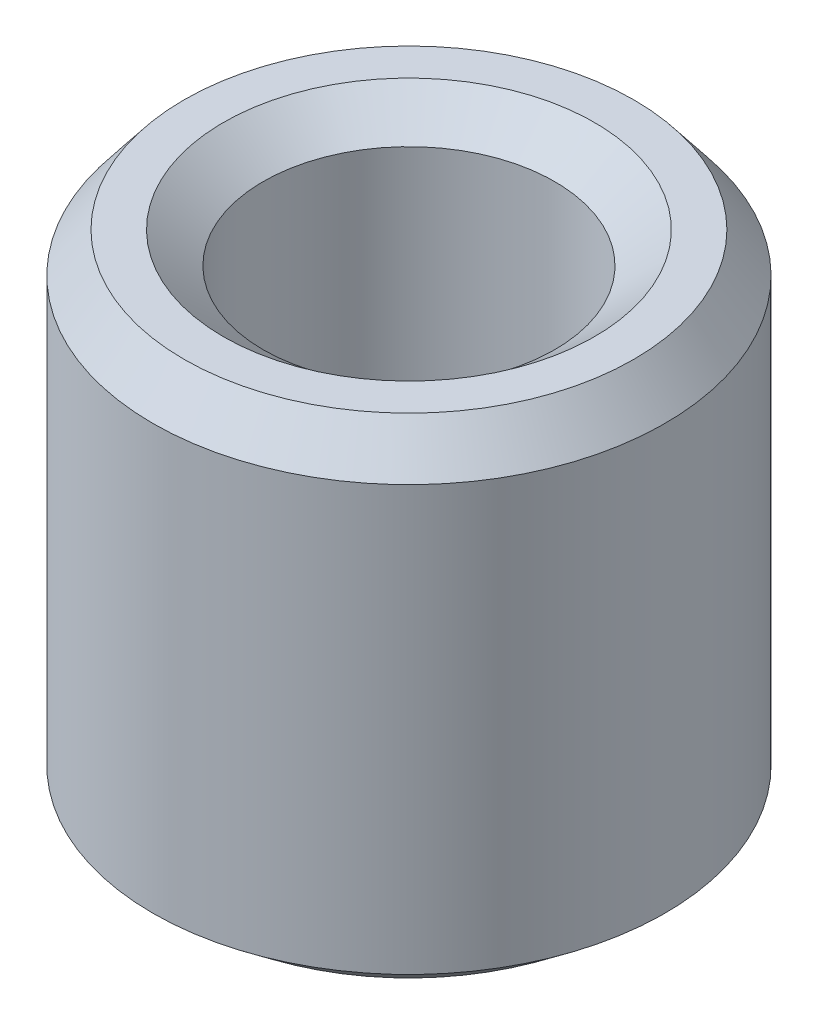
ISO-10303-21;
HEADER;
FILE_DESCRIPTION(('STEP AP214'),'2;1');
FILE_NAME('part.step','',(''),(''),'','','');
FILE_SCHEMA(('AUTOMOTIVE_DESIGN { 1 0 10303 214 1 1 1 1 }'));
ENDSEC;
DATA;
#1=APPLICATION_CONTEXT('core data for automotive mechanical design processes');
#2=APPLICATION_PROTOCOL_DEFINITION('international standard','automotive_design',2000,#1);
#3=PRODUCT_CONTEXT('',#1,'mechanical');
#4=PRODUCT('Part','Part','',(#3));
#5=PRODUCT_RELATED_PRODUCT_CATEGORY('part','',(#4));
#6=PRODUCT_DEFINITION_FORMATION('','',#4);
#7=PRODUCT_DEFINITION_CONTEXT('part definition',#1,'design');
#8=PRODUCT_DEFINITION('design','',#6,#7);
#9=PRODUCT_DEFINITION_SHAPE('','',#8);
#10=(LENGTH_UNIT() NAMED_UNIT(*) SI_UNIT(.MILLI.,.METRE.));
#11=(NAMED_UNIT(*) PLANE_ANGLE_UNIT() SI_UNIT($,.RADIAN.));
#12=(NAMED_UNIT(*) SI_UNIT($,.STERADIAN.) SOLID_ANGLE_UNIT());
#13=UNCERTAINTY_MEASURE_WITH_UNIT(LENGTH_MEASURE(1.E-05),#10,'distance_accuracy_value','');
#14=(GEOMETRIC_REPRESENTATION_CONTEXT(3) GLOBAL_UNCERTAINTY_ASSIGNED_CONTEXT((#13)) GLOBAL_UNIT_ASSIGNED_CONTEXT((#10,
#11,#12)) REPRESENTATION_CONTEXT('',''));
#15=CARTESIAN_POINT('',(0.,0.,0.));
#16=DIRECTION('',(0.,0.,1.));
#17=DIRECTION('',(1.,0.,0.));
#18=AXIS2_PLACEMENT_3D('',#15,#16,#17);
#19=CARTESIAN_POINT('',(0.,19.341662346235,0.));
#20=DIRECTION('',(0.,-1.,0.));
#21=DIRECTION('',(0.,0.,-1.));
#22=AXIS2_PLACEMENT_3D('',#19,#20,#21);
#23=CYLINDRICAL_SURFACE('',#22,10.);
#24=CARTESIAN_POINT('',(0.,1.21956495518071,0.));
#25=DIRECTION('',(0.,1.,0.));
#26=DIRECTION('',(0.,0.,1.));
#27=AXIS2_PLACEMENT_3D('',#24,#25,#26);
#28=CIRCLE('',#27,10.);
#29=CARTESIAN_POINT('',(0.,1.21956495518071,10.));
#30=VERTEX_POINT('',#29);
#31=EDGE_CURVE('E10',#30,#30,#28,.T.);
#32=ORIENTED_EDGE('',*,*,#31,.T.);
#33=EDGE_LOOP('',(#32));
#34=FACE_BOUND('',#33,.T.);
#35=CARTESIAN_POINT('',(0.,17.785517601002,0.));
#36=DIRECTION('',(0.,1.,0.));
#37=DIRECTION('',(0.,0.,1.));
#38=AXIS2_PLACEMENT_3D('',#35,#36,#37);
#39=CIRCLE('',#38,10.);
#40=CARTESIAN_POINT('',(0.,17.785517601002,10.));
#41=VERTEX_POINT('',#40);
#42=EDGE_CURVE('E50',#41,#41,#39,.F.);
#43=ORIENTED_EDGE('',*,*,#42,.T.);
#44=EDGE_LOOP('',(#43));
#45=FACE_BOUND('',#44,.T.);
#46=ADVANCED_FACE('F39',(#34,#45),#23,.T.);
#47=CARTESIAN_POINT('',(0.,19.341662346235,0.));
#48=DIRECTION('',(0.,1.,0.));
#49=DIRECTION('',(0.,0.,1.));
#50=AXIS2_PLACEMENT_3D('',#47,#48,#49);
#51=PLANE('',#50);
#52=CARTESIAN_POINT('',(0.,19.341662346235,0.));
#53=DIRECTION('',(0.,1.,0.));
#54=DIRECTION('',(0.,0.,1.));
#55=AXIS2_PLACEMENT_3D('',#52,#53,#54);
#56=CIRCLE('',#55,7.24723734609142);
#57=CARTESIAN_POINT('',(0.,19.341662346235,7.24723734609142));
#58=VERTEX_POINT('',#57);
#59=EDGE_CURVE('E58',#58,#58,#56,.F.);
#60=ORIENTED_EDGE('',*,*,#59,.T.);
#61=EDGE_LOOP('',(#60));
#62=FACE_BOUND('',#61,.T.);
#63=CARTESIAN_POINT('',(0.,19.341662346235,0.));
#64=DIRECTION('',(0.,1.,0.));
#65=DIRECTION('',(0.,0.,1.));
#66=AXIS2_PLACEMENT_3D('',#63,#64,#65);
#67=CIRCLE('',#66,8.7804350448193);
#68=CARTESIAN_POINT('',(0.,19.341662346235,8.7804350448193));
#69=VERTEX_POINT('',#68);
#70=EDGE_CURVE('E61',#69,#69,#67,.T.);
#71=ORIENTED_EDGE('',*,*,#70,.T.);
#72=EDGE_LOOP('',(#71));
#73=FACE_BOUND('',#72,.T.);
#74=ADVANCED_FACE('F88',(#62,#73),#51,.T.);
#75=CARTESIAN_POINT('',(0.,0.,0.));
#76=DIRECTION('',(0.,1.,0.));
#77=DIRECTION('',(0.,0.,1.));
#78=AXIS2_PLACEMENT_3D('',#75,#76,#77);
#79=PLANE('',#78);
#80=CARTESIAN_POINT('',(0.,0.,0.));
#81=DIRECTION('',(0.,1.,0.));
#82=DIRECTION('',(0.,0.,1.));
#83=AXIS2_PLACEMENT_3D('',#80,#81,#82);
#84=CIRCLE('',#83,6.9106575560391);
#85=CARTESIAN_POINT('',(0.,0.,6.9106575560391));
#86=VERTEX_POINT('',#85);
#87=EDGE_CURVE('E51',#86,#86,#84,.T.);
#88=ORIENTED_EDGE('',*,*,#87,.T.);
#89=EDGE_LOOP('',(#88));
#90=FACE_BOUND('',#89,.T.);
#91=CARTESIAN_POINT('',(0.,0.,0.));
#92=DIRECTION('',(0.,1.,0.));
#93=DIRECTION('',(0.,0.,1.));
#94=AXIS2_PLACEMENT_3D('',#91,#92,#93);
#95=CIRCLE('',#94,8.44385525476696);
#96=CARTESIAN_POINT('',(0.,0.,8.44385525476696));
#97=VERTEX_POINT('',#96);
#98=EDGE_CURVE('E54',#97,#97,#95,.F.);
#99=ORIENTED_EDGE('',*,*,#98,.T.);
#100=EDGE_LOOP('',(#99));
#101=FACE_BOUND('',#100,.T.);
#102=ADVANCED_FACE('F83',(#90,#101),#79,.F.);
#103=CARTESIAN_POINT('',(0.,19.341662346235,0.));
#104=DIRECTION('',(0.,-1.,0.));
#105=DIRECTION('',(0.,0.,-1.));
#106=AXIS2_PLACEMENT_3D('',#103,#104,#105);
#107=CYLINDRICAL_SURFACE('',#106,5.69109260085839);
#108=CARTESIAN_POINT('',(0.,18.1220973910543,0.));
#109=DIRECTION('',(0.,1.,0.));
#110=DIRECTION('',(0.,0.,1.));
#111=AXIS2_PLACEMENT_3D('',#108,#109,#110);
#112=CIRCLE('',#111,5.69109260085839);
#113=CARTESIAN_POINT('',(0.,18.1220973910543,5.69109260085839));
#114=VERTEX_POINT('',#113);
#115=EDGE_CURVE('E67',#114,#114,#112,.T.);
#116=ORIENTED_EDGE('',*,*,#115,.T.);
#117=EDGE_LOOP('',(#116));
#118=FACE_BOUND('',#117,.T.);
#119=CARTESIAN_POINT('',(0.,1.55614474523303,0.));
#120=DIRECTION('',(0.,1.,0.));
#121=DIRECTION('',(0.,0.,1.));
#122=AXIS2_PLACEMENT_3D('',#119,#120,#121);
#123=CIRCLE('',#122,5.69109260085839);
#124=CARTESIAN_POINT('',(0.,1.55614474523303,5.69109260085839));
#125=VERTEX_POINT('',#124);
#126=EDGE_CURVE('E69',#125,#125,#123,.F.);
#127=ORIENTED_EDGE('',*,*,#126,.T.);
#128=EDGE_LOOP('',(#127));
#129=FACE_BOUND('',#128,.T.);
#130=ADVANCED_FACE('F71',(#118,#129),#107,.F.);
#131=CARTESIAN_POINT('',(0.,18.1220973910543,0.));
#132=DIRECTION('',(0.,1.,0.));
#133=DIRECTION('',(0.,0.,1.));
#134=AXIS2_PLACEMENT_3D('',#131,#132,#133);
#135=CONICAL_SURFACE('',#134,5.69109260085839,0.906068034378057);
#136=ORIENTED_EDGE('',*,*,#59,.F.);
#137=EDGE_LOOP('',(#136));
#138=FACE_BOUND('',#137,.T.);
#139=ORIENTED_EDGE('',*,*,#115,.F.);
#140=EDGE_LOOP('',(#139));
#141=FACE_BOUND('',#140,.T.);
#142=ADVANCED_FACE('F77',(#138,#141),#135,.F.);
#143=CARTESIAN_POINT('',(0.,0.,0.));
#144=DIRECTION('',(0.,-1.,0.));
#145=DIRECTION('',(0.,0.,-1.));
#146=AXIS2_PLACEMENT_3D('',#143,#144,#145);
#147=CONICAL_SURFACE('',#146,6.9106575560391,0.664728292416841);
#148=ORIENTED_EDGE('',*,*,#126,.F.);
#149=EDGE_LOOP('',(#148));
#150=FACE_BOUND('',#149,.T.);
#151=ORIENTED_EDGE('',*,*,#87,.F.);
#152=EDGE_LOOP('',(#151));
#153=FACE_BOUND('',#152,.T.);
#154=ADVANCED_FACE('F73',(#150,#153),#147,.F.);
#155=CARTESIAN_POINT('',(0.,1.21956495518071,0.));
#156=DIRECTION('',(0.,1.,0.));
#157=DIRECTION('',(0.,0.,1.));
#158=AXIS2_PLACEMENT_3D('',#155,#156,#157);
#159=CONICAL_SURFACE('',#158,10.,0.906068034378056);
#160=ORIENTED_EDGE('',*,*,#98,.F.);
#161=EDGE_LOOP('',(#160));
#162=FACE_BOUND('',#161,.T.);
#163=ORIENTED_EDGE('',*,*,#31,.F.);
#164=EDGE_LOOP('',(#163));
#165=FACE_BOUND('',#164,.T.);
#166=ADVANCED_FACE('F76',(#162,#165),#159,.T.);
#167=CARTESIAN_POINT('',(0.,19.341662346235,0.));
#168=DIRECTION('',(0.,-1.,0.));
#169=DIRECTION('',(0.,0.,-1.));
#170=AXIS2_PLACEMENT_3D('',#167,#168,#169);
#171=CONICAL_SURFACE('',#170,8.7804350448193,0.664728292416842);
#172=ORIENTED_EDGE('',*,*,#42,.F.);
#173=EDGE_LOOP('',(#172));
#174=FACE_BOUND('',#173,.T.);
#175=ORIENTED_EDGE('',*,*,#70,.F.);
#176=EDGE_LOOP('',(#175));
#177=FACE_BOUND('',#176,.T.);
#178=ADVANCED_FACE('F45',(#174,#177),#171,.T.);
#179=CLOSED_SHELL('',(#46,#74,#102,#130,#142,#154,#166,#178));
#180=MANIFOLD_SOLID_BREP('B2',#179);
#181=ADVANCED_BREP_SHAPE_REPRESENTATION('',(#18,#180),#14);
#182=SHAPE_DEFINITION_REPRESENTATION(#9,#181);
ENDSEC;
END-ISO-10303-21;
